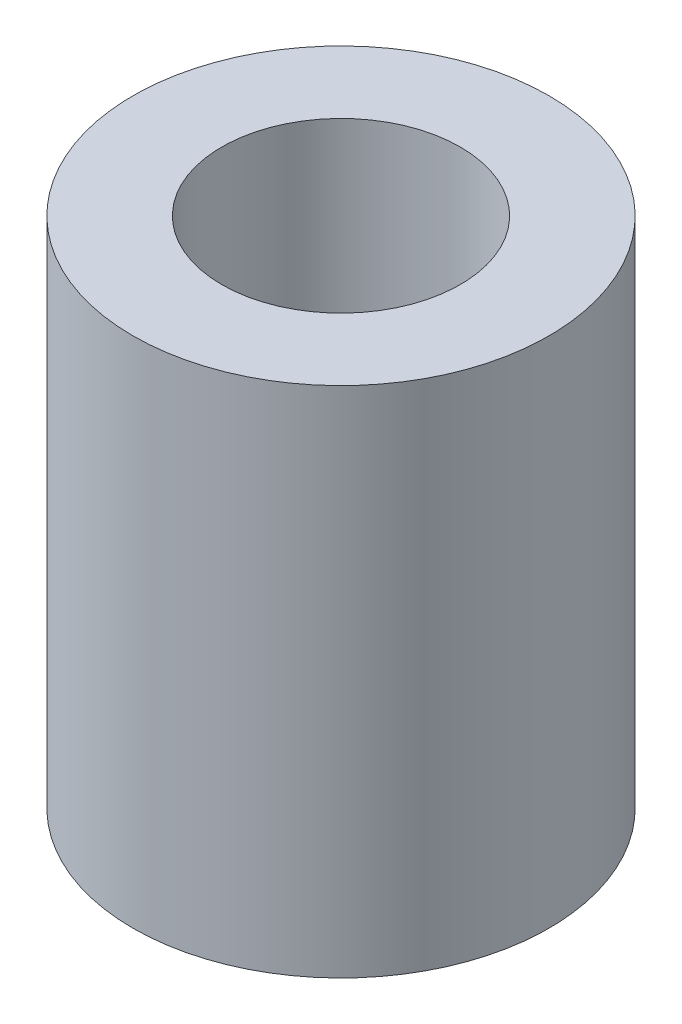
ISO-10303-21;
HEADER;
FILE_DESCRIPTION(('STEP AP214'),'2;1');
FILE_NAME('part.step','',(''),(''),'','','');
FILE_SCHEMA(('AUTOMOTIVE_DESIGN { 1 0 10303 214 1 1 1 1 }'));
ENDSEC;
DATA;
#1=APPLICATION_CONTEXT('core data for automotive mechanical design processes');
#2=APPLICATION_PROTOCOL_DEFINITION('international standard','automotive_design',2000,#1);
#3=PRODUCT_CONTEXT('',#1,'mechanical');
#4=PRODUCT('Part','Part','',(#3));
#5=PRODUCT_RELATED_PRODUCT_CATEGORY('part','',(#4));
#6=PRODUCT_DEFINITION_FORMATION('','',#4);
#7=PRODUCT_DEFINITION_CONTEXT('part definition',#1,'design');
#8=PRODUCT_DEFINITION('design','',#6,#7);
#9=PRODUCT_DEFINITION_SHAPE('','',#8);
#10=(LENGTH_UNIT() NAMED_UNIT(*) SI_UNIT(.MILLI.,.METRE.));
#11=(NAMED_UNIT(*) PLANE_ANGLE_UNIT() SI_UNIT($,.RADIAN.));
#12=(NAMED_UNIT(*) SI_UNIT($,.STERADIAN.) SOLID_ANGLE_UNIT());
#13=UNCERTAINTY_MEASURE_WITH_UNIT(LENGTH_MEASURE(1.E-05),#10,'distance_accuracy_value','');
#14=(GEOMETRIC_REPRESENTATION_CONTEXT(3) GLOBAL_UNCERTAINTY_ASSIGNED_CONTEXT((#13)) GLOBAL_UNIT_ASSIGNED_CONTEXT((#10,
#11,#12)) REPRESENTATION_CONTEXT('',''));
#15=CARTESIAN_POINT('',(0.,0.,0.));
#16=DIRECTION('',(0.,0.,1.));
#17=DIRECTION('',(1.,0.,0.));
#18=AXIS2_PLACEMENT_3D('',#15,#16,#17);
#19=CARTESIAN_POINT('',(0.,11.7475,0.));
#20=DIRECTION('',(0.,1.,0.));
#21=DIRECTION('',(0.,0.,1.));
#22=AXIS2_PLACEMENT_3D('',#19,#20,#21);
#23=PLANE('',#22);
#24=CARTESIAN_POINT('',(0.,11.7475,0.));
#25=DIRECTION('',(0.,1.,0.));
#26=DIRECTION('',(0.,0.,1.));
#27=AXIS2_PLACEMENT_3D('',#24,#25,#26);
#28=CIRCLE('',#27,4.7625);
#29=CARTESIAN_POINT('',(0.,11.7475,4.7625));
#30=VERTEX_POINT('',#29);
#31=EDGE_CURVE('E10',#30,#30,#28,.T.);
#32=ORIENTED_EDGE('',*,*,#31,.T.);
#33=EDGE_LOOP('',(#32));
#34=FACE_BOUND('',#33,.T.);
#35=CARTESIAN_POINT('',(0.,11.7475,0.));
#36=DIRECTION('',(0.,1.,0.));
#37=DIRECTION('',(0.,0.,1.));
#38=AXIS2_PLACEMENT_3D('',#35,#36,#37);
#39=CIRCLE('',#38,2.7305);
#40=CARTESIAN_POINT('',(0.,11.7475,2.7305));
#41=VERTEX_POINT('',#40);
#42=EDGE_CURVE('E42',#41,#41,#39,.T.);
#43=ORIENTED_EDGE('',*,*,#42,.F.);
#44=EDGE_LOOP('',(#43));
#45=FACE_BOUND('',#44,.T.);
#46=ADVANCED_FACE('F31',(#34,#45),#23,.T.);
#47=CARTESIAN_POINT('',(0.,0.,0.));
#48=DIRECTION('',(0.,1.,0.));
#49=DIRECTION('',(0.,0.,1.));
#50=AXIS2_PLACEMENT_3D('',#47,#48,#49);
#51=PLANE('',#50);
#52=CARTESIAN_POINT('',(0.,0.,0.));
#53=DIRECTION('',(0.,1.,0.));
#54=DIRECTION('',(0.,0.,1.));
#55=AXIS2_PLACEMENT_3D('',#52,#53,#54);
#56=CIRCLE('',#55,4.7625);
#57=CARTESIAN_POINT('',(0.,0.,4.7625));
#58=VERTEX_POINT('',#57);
#59=EDGE_CURVE('E35',#58,#58,#56,.T.);
#60=ORIENTED_EDGE('',*,*,#59,.F.);
#61=EDGE_LOOP('',(#60));
#62=FACE_BOUND('',#61,.T.);
#63=CARTESIAN_POINT('',(0.,0.,0.));
#64=DIRECTION('',(0.,1.,0.));
#65=DIRECTION('',(0.,0.,1.));
#66=AXIS2_PLACEMENT_3D('',#63,#64,#65);
#67=CIRCLE('',#66,2.7305);
#68=CARTESIAN_POINT('',(0.,0.,2.7305));
#69=VERTEX_POINT('',#68);
#70=EDGE_CURVE('E44',#69,#69,#67,.T.);
#71=ORIENTED_EDGE('',*,*,#70,.T.);
#72=EDGE_LOOP('',(#71));
#73=FACE_BOUND('',#72,.T.);
#74=ADVANCED_FACE('F54',(#62,#73),#51,.F.);
#75=CARTESIAN_POINT('',(0.,11.7475,0.));
#76=DIRECTION('',(0.,-1.,0.));
#77=DIRECTION('',(0.,0.,-1.));
#78=AXIS2_PLACEMENT_3D('',#75,#76,#77);
#79=CYLINDRICAL_SURFACE('',#78,4.7625);
#80=ORIENTED_EDGE('',*,*,#31,.F.);
#81=EDGE_LOOP('',(#80));
#82=FACE_BOUND('',#81,.T.);
#83=ORIENTED_EDGE('',*,*,#59,.T.);
#84=EDGE_LOOP('',(#83));
#85=FACE_BOUND('',#84,.T.);
#86=ADVANCED_FACE('F33',(#82,#85),#79,.T.);
#87=CARTESIAN_POINT('',(0.,11.7475,0.));
#88=DIRECTION('',(0.,-1.,0.));
#89=DIRECTION('',(0.,0.,-1.));
#90=AXIS2_PLACEMENT_3D('',#87,#88,#89);
#91=CYLINDRICAL_SURFACE('',#90,2.7305);
#92=ORIENTED_EDGE('',*,*,#42,.T.);
#93=EDGE_LOOP('',(#92));
#94=FACE_BOUND('',#93,.T.);
#95=ORIENTED_EDGE('',*,*,#70,.F.);
#96=EDGE_LOOP('',(#95));
#97=FACE_BOUND('',#96,.T.);
#98=ADVANCED_FACE('F50',(#94,#97),#91,.F.);
#99=CLOSED_SHELL('',(#46,#74,#86,#98));
#100=MANIFOLD_SOLID_BREP('B2',#99);
#101=ADVANCED_BREP_SHAPE_REPRESENTATION('',(#18,#100),#14);
#102=SHAPE_DEFINITION_REPRESENTATION(#9,#101);
ENDSEC;
END-ISO-10303-21;
